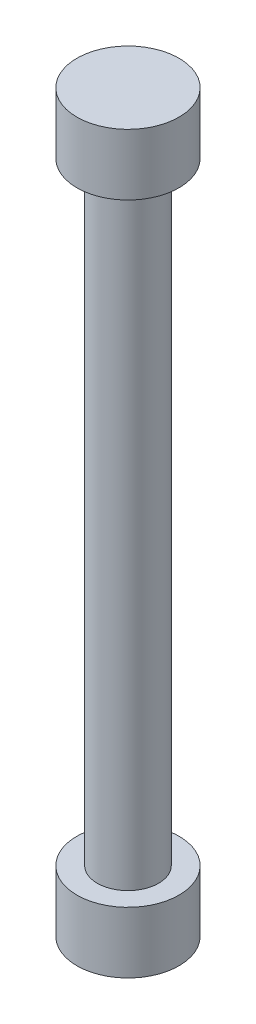
ISO-10303-21;
HEADER;
FILE_DESCRIPTION(('STEP AP214'),'2;1');
FILE_NAME('part.step','',(''),(''),'','','');
FILE_SCHEMA(('AUTOMOTIVE_DESIGN { 1 0 10303 214 1 1 1 1 }'));
ENDSEC;
DATA;
#1=APPLICATION_CONTEXT('core data for automotive mechanical design processes');
#2=APPLICATION_PROTOCOL_DEFINITION('international standard','automotive_design',2000,#1);
#3=PRODUCT_CONTEXT('',#1,'mechanical');
#4=PRODUCT('Part','Part','',(#3));
#5=PRODUCT_RELATED_PRODUCT_CATEGORY('part','',(#4));
#6=PRODUCT_DEFINITION_FORMATION('','',#4);
#7=PRODUCT_DEFINITION_CONTEXT('part definition',#1,'design');
#8=PRODUCT_DEFINITION('design','',#6,#7);
#9=PRODUCT_DEFINITION_SHAPE('','',#8);
#10=(LENGTH_UNIT() NAMED_UNIT(*) SI_UNIT(.MILLI.,.METRE.));
#11=(NAMED_UNIT(*) PLANE_ANGLE_UNIT() SI_UNIT($,.RADIAN.));
#12=(NAMED_UNIT(*) SI_UNIT($,.STERADIAN.) SOLID_ANGLE_UNIT());
#13=UNCERTAINTY_MEASURE_WITH_UNIT(LENGTH_MEASURE(1.E-05),#10,'distance_accuracy_value','');
#14=(GEOMETRIC_REPRESENTATION_CONTEXT(3) GLOBAL_UNCERTAINTY_ASSIGNED_CONTEXT((#13)) GLOBAL_UNIT_ASSIGNED_CONTEXT((#10,
#11,#12)) REPRESENTATION_CONTEXT('',''));
#15=CARTESIAN_POINT('',(0.,0.,0.));
#16=DIRECTION('',(0.,0.,1.));
#17=DIRECTION('',(1.,0.,0.));
#18=AXIS2_PLACEMENT_3D('',#15,#16,#17);
#19=CARTESIAN_POINT('',(0.,9.525,0.));
#20=DIRECTION('',(0.,-1.,0.));
#21=DIRECTION('',(0.,0.,-1.));
#22=AXIS2_PLACEMENT_3D('',#19,#20,#21);
#23=CYLINDRICAL_SURFACE('',#22,0.9525);
#24=CARTESIAN_POINT('',(0.,9.525,0.));
#25=DIRECTION('',(0.,1.,0.));
#26=DIRECTION('',(0.,0.,1.));
#27=AXIS2_PLACEMENT_3D('',#24,#25,#26);
#28=CIRCLE('',#27,0.9525);
#29=CARTESIAN_POINT('',(0.,9.525,0.9525));
#30=VERTEX_POINT('',#29);
#31=EDGE_CURVE('E10',#30,#30,#28,.T.);
#32=ORIENTED_EDGE('',*,*,#31,.F.);
#33=EDGE_LOOP('',(#32));
#34=FACE_BOUND('',#33,.T.);
#35=CARTESIAN_POINT('',(0.,-9.525,0.));
#36=DIRECTION('',(0.,1.,0.));
#37=DIRECTION('',(0.,0.,1.));
#38=AXIS2_PLACEMENT_3D('',#35,#36,#37);
#39=CIRCLE('',#38,0.9525);
#40=CARTESIAN_POINT('',(0.,-9.525,0.9525));
#41=VERTEX_POINT('',#40);
#42=EDGE_CURVE('E50',#41,#41,#39,.T.);
#43=ORIENTED_EDGE('',*,*,#42,.T.);
#44=EDGE_LOOP('',(#43));
#45=FACE_BOUND('',#44,.T.);
#46=ADVANCED_FACE('F35',(#34,#45),#23,.T.);
#47=CARTESIAN_POINT('',(0.,11.43,0.));
#48=DIRECTION('',(0.,-1.,0.));
#49=DIRECTION('',(0.,0.,-1.));
#50=AXIS2_PLACEMENT_3D('',#47,#48,#49);
#51=CYLINDRICAL_SURFACE('',#50,1.5875);
#52=CARTESIAN_POINT('',(0.,11.43,0.));
#53=DIRECTION('',(0.,1.,0.));
#54=DIRECTION('',(0.,0.,1.));
#55=AXIS2_PLACEMENT_3D('',#52,#53,#54);
#56=CIRCLE('',#55,1.5875);
#57=CARTESIAN_POINT('',(0.,11.43,1.5875));
#58=VERTEX_POINT('',#57);
#59=EDGE_CURVE('E41',#58,#58,#56,.T.);
#60=ORIENTED_EDGE('',*,*,#59,.F.);
#61=EDGE_LOOP('',(#60));
#62=FACE_BOUND('',#61,.T.);
#63=CARTESIAN_POINT('',(0.,9.525,0.));
#64=DIRECTION('',(0.,1.,0.));
#65=DIRECTION('',(0.,0.,1.));
#66=AXIS2_PLACEMENT_3D('',#63,#64,#65);
#67=CIRCLE('',#66,1.5875);
#68=CARTESIAN_POINT('',(0.,9.525,1.5875));
#69=VERTEX_POINT('',#68);
#70=EDGE_CURVE('E45',#69,#69,#67,.T.);
#71=ORIENTED_EDGE('',*,*,#70,.T.);
#72=EDGE_LOOP('',(#71));
#73=FACE_BOUND('',#72,.T.);
#74=ADVANCED_FACE('F77',(#62,#73),#51,.T.);
#75=CARTESIAN_POINT('',(0.,11.43,0.));
#76=DIRECTION('',(0.,1.,0.));
#77=DIRECTION('',(0.,0.,1.));
#78=AXIS2_PLACEMENT_3D('',#75,#76,#77);
#79=PLANE('',#78);
#80=ORIENTED_EDGE('',*,*,#59,.T.);
#81=EDGE_LOOP('',(#80));
#82=FACE_BOUND('',#81,.T.);
#83=ADVANCED_FACE('F82',(#82),#79,.T.);
#84=CARTESIAN_POINT('',(0.,9.525,0.));
#85=DIRECTION('',(0.,1.,0.));
#86=DIRECTION('',(0.,0.,1.));
#87=AXIS2_PLACEMENT_3D('',#84,#85,#86);
#88=PLANE('',#87);
#89=ORIENTED_EDGE('',*,*,#31,.T.);
#90=EDGE_LOOP('',(#89));
#91=FACE_BOUND('',#90,.T.);
#92=ORIENTED_EDGE('',*,*,#70,.F.);
#93=EDGE_LOOP('',(#92));
#94=FACE_BOUND('',#93,.T.);
#95=ADVANCED_FACE('F74',(#91,#94),#88,.F.);
#96=CARTESIAN_POINT('',(0.,-11.43,0.));
#97=DIRECTION('',(0.,1.,0.));
#98=DIRECTION('',(0.,0.,1.));
#99=AXIS2_PLACEMENT_3D('',#96,#97,#98);
#100=CYLINDRICAL_SURFACE('',#99,1.5875);
#101=CARTESIAN_POINT('',(0.,-11.43,0.));
#102=DIRECTION('',(0.,1.,0.));
#103=DIRECTION('',(0.,0.,1.));
#104=AXIS2_PLACEMENT_3D('',#101,#102,#103);
#105=CIRCLE('',#104,1.5875);
#106=CARTESIAN_POINT('',(0.,-11.43,1.5875));
#107=VERTEX_POINT('',#106);
#108=EDGE_CURVE('E54',#107,#107,#105,.T.);
#109=ORIENTED_EDGE('',*,*,#108,.T.);
#110=EDGE_LOOP('',(#109));
#111=FACE_BOUND('',#110,.T.);
#112=CARTESIAN_POINT('',(0.,-9.525,0.));
#113=DIRECTION('',(0.,1.,0.));
#114=DIRECTION('',(0.,0.,1.));
#115=AXIS2_PLACEMENT_3D('',#112,#113,#114);
#116=CIRCLE('',#115,1.5875);
#117=CARTESIAN_POINT('',(0.,-9.525,1.5875));
#118=VERTEX_POINT('',#117);
#119=EDGE_CURVE('E55',#118,#118,#116,.T.);
#120=ORIENTED_EDGE('',*,*,#119,.F.);
#121=EDGE_LOOP('',(#120));
#122=FACE_BOUND('',#121,.T.);
#123=ADVANCED_FACE('F61',(#111,#122),#100,.T.);
#124=CARTESIAN_POINT('',(0.,-11.43,0.));
#125=DIRECTION('',(0.,-1.,0.));
#126=DIRECTION('',(0.,0.,1.));
#127=AXIS2_PLACEMENT_3D('',#124,#125,#126);
#128=PLANE('',#127);
#129=ORIENTED_EDGE('',*,*,#108,.F.);
#130=EDGE_LOOP('',(#129));
#131=FACE_BOUND('',#130,.T.);
#132=ADVANCED_FACE('F64',(#131),#128,.T.);
#133=CARTESIAN_POINT('',(0.,-9.525,0.));
#134=DIRECTION('',(0.,-1.,0.));
#135=DIRECTION('',(0.,0.,1.));
#136=AXIS2_PLACEMENT_3D('',#133,#134,#135);
#137=PLANE('',#136);
#138=ORIENTED_EDGE('',*,*,#42,.F.);
#139=EDGE_LOOP('',(#138));
#140=FACE_BOUND('',#139,.T.);
#141=ORIENTED_EDGE('',*,*,#119,.T.);
#142=EDGE_LOOP('',(#141));
#143=FACE_BOUND('',#142,.T.);
#144=ADVANCED_FACE('F66',(#140,#143),#137,.F.);
#145=CLOSED_SHELL('',(#46,#74,#83,#95,#123,#132,#144));
#146=MANIFOLD_SOLID_BREP('B2',#145);
#147=ADVANCED_BREP_SHAPE_REPRESENTATION('',(#18,#146),#14);
#148=SHAPE_DEFINITION_REPRESENTATION(#9,#147);
ENDSEC;
END-ISO-10303-21;
